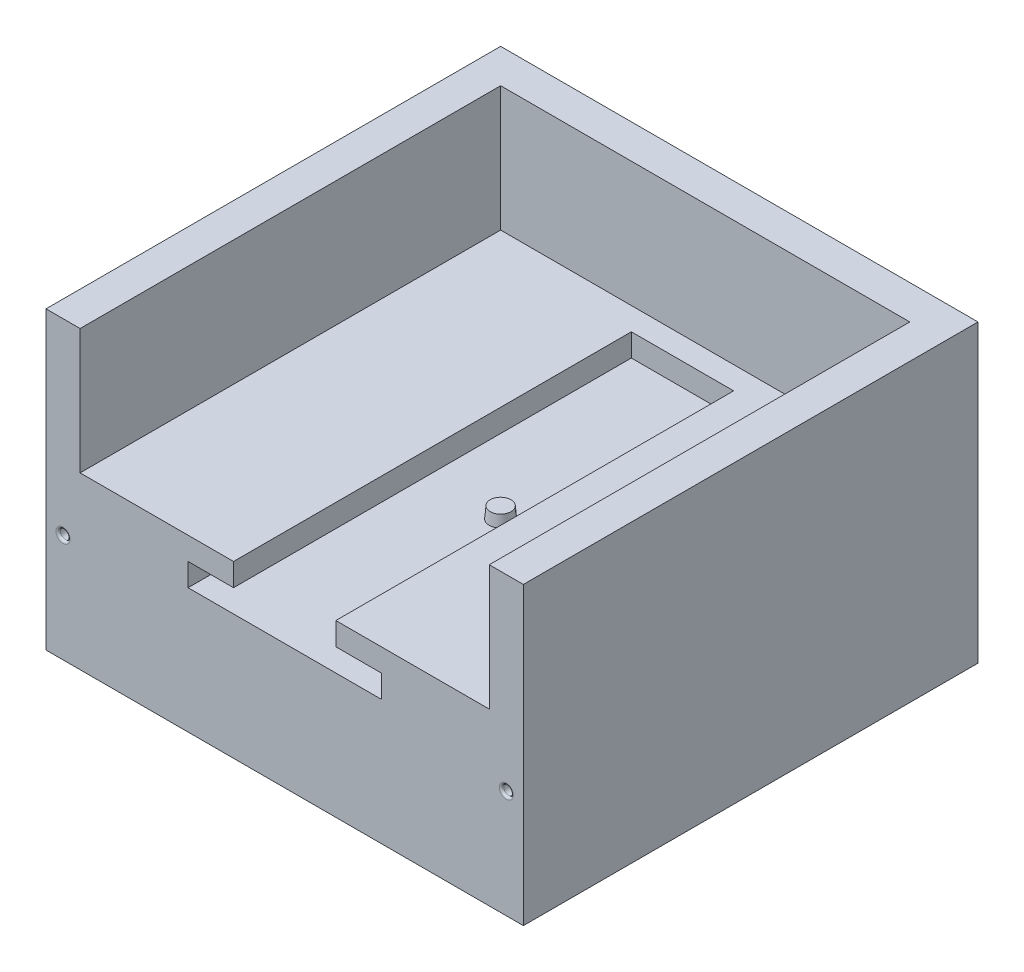
ISO-10303-21;
HEADER;
FILE_DESCRIPTION(('STEP AP214'),'2;1');
FILE_NAME('part.step','',(''),(''),'','','');
FILE_SCHEMA(('AUTOMOTIVE_DESIGN { 1 0 10303 214 1 1 1 1 }'));
ENDSEC;
DATA;
#1=APPLICATION_CONTEXT('core data for automotive mechanical design processes');
#2=APPLICATION_PROTOCOL_DEFINITION('international standard','automotive_design',2000,#1);
#3=PRODUCT_CONTEXT('',#1,'mechanical');
#4=PRODUCT('Part','Part','',(#3));
#5=PRODUCT_RELATED_PRODUCT_CATEGORY('part','',(#4));
#6=PRODUCT_DEFINITION_FORMATION('','',#4);
#7=PRODUCT_DEFINITION_CONTEXT('part definition',#1,'design');
#8=PRODUCT_DEFINITION('design','',#6,#7);
#9=PRODUCT_DEFINITION_SHAPE('','',#8);
#10=(LENGTH_UNIT() NAMED_UNIT(*) SI_UNIT(.MILLI.,.METRE.));
#11=(NAMED_UNIT(*) PLANE_ANGLE_UNIT() SI_UNIT($,.RADIAN.));
#12=(NAMED_UNIT(*) SI_UNIT($,.STERADIAN.) SOLID_ANGLE_UNIT());
#13=UNCERTAINTY_MEASURE_WITH_UNIT(LENGTH_MEASURE(1.E-05),#10,'distance_accuracy_value','');
#14=(GEOMETRIC_REPRESENTATION_CONTEXT(3) GLOBAL_UNCERTAINTY_ASSIGNED_CONTEXT((#13)) GLOBAL_UNIT_ASSIGNED_CONTEXT((#10,
#11,#12)) REPRESENTATION_CONTEXT('',''));
#15=CARTESIAN_POINT('',(0.,0.,0.));
#16=DIRECTION('',(0.,0.,1.));
#17=DIRECTION('',(1.,0.,0.));
#18=AXIS2_PLACEMENT_3D('',#15,#16,#17);
#19=CARTESIAN_POINT('',(0.,75.,0.));
#20=DIRECTION('',(0.,1.,0.));
#21=DIRECTION('',(0.,0.,1.));
#22=AXIS2_PLACEMENT_3D('',#19,#20,#21);
#23=PLANE('',#22);
#24=DIRECTION('',(0.,0.,-1.));
#25=VECTOR('',#24,1.);
#26=CARTESIAN_POINT('',(-90.,75.,0.));
#27=LINE('',#26,#25);
#28=CARTESIAN_POINT('',(-90.,75.,185.));
#29=VERTEX_POINT('',#28);
#30=CARTESIAN_POINT('',(-90.,75.,0.));
#31=VERTEX_POINT('',#30);
#32=EDGE_CURVE('E404',#29,#31,#27,.T.);
#33=ORIENTED_EDGE('',*,*,#32,.T.);
#34=DIRECTION('',(1.,0.,0.));
#35=VECTOR('',#34,1.);
#36=CARTESIAN_POINT('',(-90.,75.,0.));
#37=LINE('',#36,#35);
#38=CARTESIAN_POINT('',(90.,75.,0.));
#39=VERTEX_POINT('',#38);
#40=EDGE_CURVE('E407',#31,#39,#37,.T.);
#41=ORIENTED_EDGE('',*,*,#40,.T.);
#42=DIRECTION('',(0.,0.,1.));
#43=VECTOR('',#42,1.);
#44=CARTESIAN_POINT('',(90.,75.,0.));
#45=LINE('',#44,#43);
#46=CARTESIAN_POINT('',(90.,75.,185.));
#47=VERTEX_POINT('',#46);
#48=EDGE_CURVE('E218',#39,#47,#45,.T.);
#49=ORIENTED_EDGE('',*,*,#48,.T.);
#50=DIRECTION('',(1.,0.,0.));
#51=VECTOR('',#50,1.);
#52=CARTESIAN_POINT('',(-90.,75.,185.));
#53=LINE('',#52,#51);
#54=CARTESIAN_POINT('',(105.,75.,185.));
#55=VERTEX_POINT('',#54);
#56=EDGE_CURVE('E401',#47,#55,#53,.T.);
#57=ORIENTED_EDGE('',*,*,#56,.T.);
#58=DIRECTION('',(0.,0.,-1.));
#59=VECTOR('',#58,1.);
#60=CARTESIAN_POINT('',(105.,75.,-15.));
#61=LINE('',#60,#59);
#62=CARTESIAN_POINT('',(105.,75.,-15.));
#63=VERTEX_POINT('',#62);
#64=EDGE_CURVE('E208',#55,#63,#61,.T.);
#65=ORIENTED_EDGE('',*,*,#64,.T.);
#66=DIRECTION('',(-1.,0.,0.));
#67=VECTOR('',#66,1.);
#68=CARTESIAN_POINT('',(-105.,75.,-15.));
#69=LINE('',#68,#67);
#70=CARTESIAN_POINT('',(-105.,75.,-15.));
#71=VERTEX_POINT('',#70);
#72=EDGE_CURVE('E189',#63,#71,#69,.T.);
#73=ORIENTED_EDGE('',*,*,#72,.T.);
#74=DIRECTION('',(0.,0.,1.));
#75=VECTOR('',#74,1.);
#76=CARTESIAN_POINT('',(-105.,75.,185.));
#77=LINE('',#76,#75);
#78=CARTESIAN_POINT('',(-105.,75.,185.));
#79=VERTEX_POINT('',#78);
#80=EDGE_CURVE('E205',#71,#79,#77,.T.);
#81=ORIENTED_EDGE('',*,*,#80,.T.);
#82=EDGE_CURVE('E211',#79,#29,#53,.T.);
#83=ORIENTED_EDGE('',*,*,#82,.T.);
#84=EDGE_LOOP('',(#33,#41,#49,#57,#65,#73,#81,#83));
#85=FACE_BOUND('',#84,.T.);
#86=ADVANCED_FACE('F47',(#85),#23,.T.);
#87=CARTESIAN_POINT('',(-105.,225.,-15.));
#88=DIRECTION('',(0.,0.,1.));
#89=DIRECTION('',(1.,0.,0.));
#90=AXIS2_PLACEMENT_3D('',#87,#88,#89);
#91=PLANE('',#90);
#92=DIRECTION('',(-1.,0.,0.));
#93=VECTOR('',#92,1.);
#94=CARTESIAN_POINT('',(0.,10.25,-15.));
#95=LINE('',#94,#93);
#96=CARTESIAN_POINT('',(42.5,10.25,-15.));
#97=VERTEX_POINT('',#96);
#98=CARTESIAN_POINT('',(21.5,10.25,-15.));
#99=VERTEX_POINT('',#98);
#100=EDGE_CURVE('E57',#97,#99,#95,.T.);
#101=ORIENTED_EDGE('',*,*,#100,.T.);
#102=DIRECTION('',(0.,-1.,0.));
#103=VECTOR('',#102,1.);
#104=CARTESIAN_POINT('',(21.5,0.,-15.));
#105=LINE('',#104,#103);
#106=CARTESIAN_POINT('',(21.5,0.,-15.));
#107=VERTEX_POINT('',#106);
#108=EDGE_CURVE('E11',#99,#107,#105,.T.);
#109=ORIENTED_EDGE('',*,*,#108,.T.);
#110=DIRECTION('',(-1.,0.,0.));
#111=VECTOR('',#110,1.);
#112=CARTESIAN_POINT('',(0.,0.,-15.));
#113=LINE('',#112,#111);
#114=CARTESIAN_POINT('',(42.5,0.,-15.));
#115=VERTEX_POINT('',#114);
#116=EDGE_CURVE('E382',#115,#107,#113,.T.);
#117=ORIENTED_EDGE('',*,*,#116,.F.);
#118=DIRECTION('',(0.,-1.,0.));
#119=VECTOR('',#118,1.);
#120=CARTESIAN_POINT('',(42.5,0.,-15.));
#121=LINE('',#120,#119);
#122=EDGE_CURVE('E390',#97,#115,#121,.T.);
#123=ORIENTED_EDGE('',*,*,#122,.F.);
#124=EDGE_LOOP('',(#101,#109,#117,#123));
#125=FACE_BOUND('',#124,.T.);
#126=ORIENTED_EDGE('',*,*,#72,.F.);
#127=DIRECTION('',(0.,-1.,0.));
#128=VECTOR('',#127,1.);
#129=CARTESIAN_POINT('',(105.,225.,-15.));
#130=LINE('',#129,#128);
#131=CARTESIAN_POINT('',(105.,-55.,-14.9999999999999));
#132=VERTEX_POINT('',#131);
#133=EDGE_CURVE('E199',#63,#132,#130,.T.);
#134=ORIENTED_EDGE('',*,*,#133,.T.);
#135=DIRECTION('',(1.,0.,0.));
#136=VECTOR('',#135,1.);
#137=CARTESIAN_POINT('',(0.,-55.,-15.));
#138=LINE('',#137,#136);
#139=CARTESIAN_POINT('',(-105.,-55.,-15.));
#140=VERTEX_POINT('',#139);
#141=EDGE_CURVE('E192',#140,#132,#138,.T.);
#142=ORIENTED_EDGE('',*,*,#141,.F.);
#143=DIRECTION('',(0.,-1.,0.));
#144=VECTOR('',#143,1.);
#145=CARTESIAN_POINT('',(-105.,225.,-15.));
#146=LINE('',#145,#144);
#147=EDGE_CURVE('E186',#71,#140,#146,.T.);
#148=ORIENTED_EDGE('',*,*,#147,.F.);
#149=EDGE_LOOP('',(#126,#134,#142,#148));
#150=FACE_BOUND('',#149,.T.);
#151=ADVANCED_FACE('F188',(#125,#150),#91,.F.);
#152=CARTESIAN_POINT('',(-90.,225.,185.));
#153=DIRECTION('',(0.,0.,-1.));
#154=DIRECTION('',(-1.,0.,0.));
#155=AXIS2_PLACEMENT_3D('',#152,#153,#154);
#156=PLANE('',#155);
#157=CARTESIAN_POINT('',(97.4999999999999,-7.50000000000001,185.));
#158=DIRECTION('',(0.,0.,-1.));
#159=DIRECTION('',(-1.,0.,0.));
#160=AXIS2_PLACEMENT_3D('',#157,#158,#159);
#161=CIRCLE('',#160,3.1);
#162=CARTESIAN_POINT('',(94.3999999999999,-7.50000000000001,185.));
#163=VERTEX_POINT('',#162);
#164=EDGE_CURVE('E542',#163,#163,#161,.T.);
#165=ORIENTED_EDGE('',*,*,#164,.T.);
#166=EDGE_LOOP('',(#165));
#167=FACE_BOUND('',#166,.T.);
#168=CARTESIAN_POINT('',(-97.4999999999999,-7.50000000000001,185.));
#169=DIRECTION('',(0.,0.,-1.));
#170=DIRECTION('',(-1.,0.,0.));
#171=AXIS2_PLACEMENT_3D('',#168,#169,#170);
#172=CIRCLE('',#171,3.1);
#173=CARTESIAN_POINT('',(-100.6,-7.50000000000001,185.));
#174=VERTEX_POINT('',#173);
#175=EDGE_CURVE('E539',#174,#174,#172,.T.);
#176=ORIENTED_EDGE('',*,*,#175,.T.);
#177=EDGE_LOOP('',(#176));
#178=FACE_BOUND('',#177,.T.);
#179=ORIENTED_EDGE('',*,*,#82,.F.);
#180=DIRECTION('',(0.,-1.,0.));
#181=VECTOR('',#180,1.);
#182=CARTESIAN_POINT('',(-105.,225.,185.));
#183=LINE('',#182,#181);
#184=CARTESIAN_POINT('',(-105.,-55.,185.));
#185=VERTEX_POINT('',#184);
#186=EDGE_CURVE('E198',#79,#185,#183,.T.);
#187=ORIENTED_EDGE('',*,*,#186,.T.);
#188=DIRECTION('',(-1.,0.,0.));
#189=VECTOR('',#188,1.);
#190=CARTESIAN_POINT('',(0.,-55.,185.));
#191=LINE('',#190,#189);
#192=CARTESIAN_POINT('',(105.,-55.,185.));
#193=VERTEX_POINT('',#192);
#194=EDGE_CURVE('E341',#193,#185,#191,.T.);
#195=ORIENTED_EDGE('',*,*,#194,.F.);
#196=DIRECTION('',(0.,-1.,0.));
#197=VECTOR('',#196,1.);
#198=CARTESIAN_POINT('',(105.,225.,185.));
#199=LINE('',#198,#197);
#200=EDGE_CURVE('E232',#55,#193,#199,.T.);
#201=ORIENTED_EDGE('',*,*,#200,.F.);
#202=ORIENTED_EDGE('',*,*,#56,.F.);
#203=DIRECTION('',(0.,-1.,0.));
#204=VECTOR('',#203,1.);
#205=CARTESIAN_POINT('',(90.,225.,185.));
#206=LINE('',#205,#204);
#207=CARTESIAN_POINT('',(90.,20.,185.));
#208=VERTEX_POINT('',#207);
#209=EDGE_CURVE('E229',#47,#208,#206,.T.);
#210=ORIENTED_EDGE('',*,*,#209,.T.);
#211=DIRECTION('',(1.,0.,0.));
#212=VECTOR('',#211,1.);
#213=CARTESIAN_POINT('',(22.5,20.,185.));
#214=LINE('',#213,#212);
#215=CARTESIAN_POINT('',(22.5,20.,185.));
#216=VERTEX_POINT('',#215);
#217=EDGE_CURVE('E302',#216,#208,#214,.T.);
#218=ORIENTED_EDGE('',*,*,#217,.F.);
#219=DIRECTION('',(0.,-1.,0.));
#220=VECTOR('',#219,1.);
#221=CARTESIAN_POINT('',(22.5,20.,185.));
#222=LINE('',#221,#220);
#223=CARTESIAN_POINT('',(22.5,10.,185.));
#224=VERTEX_POINT('',#223);
#225=EDGE_CURVE('E267',#216,#224,#222,.T.);
#226=ORIENTED_EDGE('',*,*,#225,.T.);
#227=DIRECTION('',(1.,0.,0.));
#228=VECTOR('',#227,1.);
#229=CARTESIAN_POINT('',(22.5,10.,185.));
#230=LINE('',#229,#228);
#231=CARTESIAN_POINT('',(42.5,10.,185.));
#232=VERTEX_POINT('',#231);
#233=EDGE_CURVE('E278',#224,#232,#230,.T.);
#234=ORIENTED_EDGE('',*,*,#233,.T.);
#235=DIRECTION('',(0.,1.,0.));
#236=VECTOR('',#235,1.);
#237=CARTESIAN_POINT('',(42.5,0.,185.));
#238=LINE('',#237,#236);
#239=CARTESIAN_POINT('',(42.5,0.,185.));
#240=VERTEX_POINT('',#239);
#241=EDGE_CURVE('E353',#240,#232,#238,.T.);
#242=ORIENTED_EDGE('',*,*,#241,.F.);
#243=DIRECTION('',(-1.,0.,0.));
#244=VECTOR('',#243,1.);
#245=CARTESIAN_POINT('',(-105.,0.,185.));
#246=LINE('',#245,#244);
#247=CARTESIAN_POINT('',(-42.5,0.,185.));
#248=VERTEX_POINT('',#247);
#249=EDGE_CURVE('E294',#240,#248,#246,.T.);
#250=ORIENTED_EDGE('',*,*,#249,.T.);
#251=DIRECTION('',(0.,-1.,0.));
#252=VECTOR('',#251,1.);
#253=CARTESIAN_POINT('',(-42.5,10.,185.));
#254=LINE('',#253,#252);
#255=CARTESIAN_POINT('',(-42.5,10.,185.));
#256=VERTEX_POINT('',#255);
#257=EDGE_CURVE('E360',#256,#248,#254,.T.);
#258=ORIENTED_EDGE('',*,*,#257,.F.);
#259=DIRECTION('',(1.,0.,0.));
#260=VECTOR('',#259,1.);
#261=CARTESIAN_POINT('',(-90.,10.,185.));
#262=LINE('',#261,#260);
#263=CARTESIAN_POINT('',(-22.5,10.,185.));
#264=VERTEX_POINT('',#263);
#265=EDGE_CURVE('E291',#256,#264,#262,.T.);
#266=ORIENTED_EDGE('',*,*,#265,.T.);
#267=DIRECTION('',(0.,-1.,0.));
#268=VECTOR('',#267,1.);
#269=CARTESIAN_POINT('',(-22.5,20.,185.));
#270=LINE('',#269,#268);
#271=CARTESIAN_POINT('',(-22.5,20.,185.));
#272=VERTEX_POINT('',#271);
#273=EDGE_CURVE('E247',#272,#264,#270,.T.);
#274=ORIENTED_EDGE('',*,*,#273,.F.);
#275=DIRECTION('',(1.,0.,0.));
#276=VECTOR('',#275,1.);
#277=CARTESIAN_POINT('',(-90.,20.,185.));
#278=LINE('',#277,#276);
#279=CARTESIAN_POINT('',(-90.,20.,185.));
#280=VERTEX_POINT('',#279);
#281=EDGE_CURVE('E315',#280,#272,#278,.T.);
#282=ORIENTED_EDGE('',*,*,#281,.F.);
#283=DIRECTION('',(0.,-1.,0.));
#284=VECTOR('',#283,1.);
#285=CARTESIAN_POINT('',(-90.,225.,185.));
#286=LINE('',#285,#284);
#287=EDGE_CURVE('E51',#29,#280,#286,.T.);
#288=ORIENTED_EDGE('',*,*,#287,.F.);
#289=EDGE_LOOP('',(#179,#187,#195,#201,#202,#210,#218,#226,#234,#242,#250,#258,#266,#274,#282,#288));
#290=FACE_BOUND('',#289,.T.);
#291=ADVANCED_FACE('F419',(#167,#178,#290),#156,.F.);
#292=CARTESIAN_POINT('',(-90.,225.,0.));
#293=DIRECTION('',(-1.,0.,0.));
#294=DIRECTION('',(0.,0.,1.));
#295=AXIS2_PLACEMENT_3D('',#292,#293,#294);
#296=PLANE('',#295);
#297=ORIENTED_EDGE('',*,*,#32,.F.);
#298=ORIENTED_EDGE('',*,*,#287,.T.);
#299=DIRECTION('',(0.,0.,1.));
#300=VECTOR('',#299,1.);
#301=CARTESIAN_POINT('',(-90.,20.,185.));
#302=LINE('',#301,#300);
#303=CARTESIAN_POINT('',(-90.,20.,0.));
#304=VERTEX_POINT('',#303);
#305=EDGE_CURVE('E277',#304,#280,#302,.T.);
#306=ORIENTED_EDGE('',*,*,#305,.F.);
#307=DIRECTION('',(0.,-1.,0.));
#308=VECTOR('',#307,1.);
#309=CARTESIAN_POINT('',(-90.,225.,0.));
#310=LINE('',#309,#308);
#311=EDGE_CURVE('E222',#31,#304,#310,.T.);
#312=ORIENTED_EDGE('',*,*,#311,.F.);
#313=EDGE_LOOP('',(#297,#298,#306,#312));
#314=FACE_BOUND('',#313,.T.);
#315=ADVANCED_FACE('F447',(#314),#296,.F.);
#316=CARTESIAN_POINT('',(-90.,225.,0.));
#317=DIRECTION('',(0.,0.,-1.));
#318=DIRECTION('',(-1.,0.,0.));
#319=AXIS2_PLACEMENT_3D('',#316,#317,#318);
#320=PLANE('',#319);
#321=ORIENTED_EDGE('',*,*,#40,.F.);
#322=ORIENTED_EDGE('',*,*,#311,.T.);
#323=DIRECTION('',(-1.,0.,0.));
#324=VECTOR('',#323,1.);
#325=CARTESIAN_POINT('',(-90.,20.,0.));
#326=LINE('',#325,#324);
#327=CARTESIAN_POINT('',(90.,20.,0.));
#328=VERTEX_POINT('',#327);
#329=EDGE_CURVE('E271',#328,#304,#326,.T.);
#330=ORIENTED_EDGE('',*,*,#329,.F.);
#331=DIRECTION('',(0.,-1.,0.));
#332=VECTOR('',#331,1.);
#333=CARTESIAN_POINT('',(90.,225.,0.));
#334=LINE('',#333,#332);
#335=EDGE_CURVE('E225',#39,#328,#334,.T.);
#336=ORIENTED_EDGE('',*,*,#335,.F.);
#337=EDGE_LOOP('',(#321,#322,#330,#336));
#338=FACE_BOUND('',#337,.T.);
#339=ADVANCED_FACE('F460',(#338),#320,.F.);
#340=CARTESIAN_POINT('',(90.,225.,0.));
#341=DIRECTION('',(1.,0.,0.));
#342=DIRECTION('',(0.,0.,-1.));
#343=AXIS2_PLACEMENT_3D('',#340,#341,#342);
#344=PLANE('',#343);
#345=ORIENTED_EDGE('',*,*,#48,.F.);
#346=ORIENTED_EDGE('',*,*,#335,.T.);
#347=DIRECTION('',(0.,0.,-1.));
#348=VECTOR('',#347,1.);
#349=CARTESIAN_POINT('',(90.,20.,0.));
#350=LINE('',#349,#348);
#351=EDGE_CURVE('E298',#208,#328,#350,.T.);
#352=ORIENTED_EDGE('',*,*,#351,.F.);
#353=ORIENTED_EDGE('',*,*,#209,.F.);
#354=EDGE_LOOP('',(#345,#346,#352,#353));
#355=FACE_BOUND('',#354,.T.);
#356=ADVANCED_FACE('F49',(#355),#344,.F.);
#357=CARTESIAN_POINT('',(105.,225.,-15.));
#358=DIRECTION('',(-1.,0.,0.));
#359=DIRECTION('',(0.,0.,1.));
#360=AXIS2_PLACEMENT_3D('',#357,#358,#359);
#361=PLANE('',#360);
#362=ORIENTED_EDGE('',*,*,#64,.F.);
#363=ORIENTED_EDGE('',*,*,#200,.T.);
#364=DIRECTION('',(0.,0.,1.));
#365=VECTOR('',#364,1.);
#366=CARTESIAN_POINT('',(105.,-55.,0.));
#367=LINE('',#366,#365);
#368=EDGE_CURVE('E332',#132,#193,#367,.T.);
#369=ORIENTED_EDGE('',*,*,#368,.F.);
#370=ORIENTED_EDGE('',*,*,#133,.F.);
#371=EDGE_LOOP('',(#362,#363,#369,#370));
#372=FACE_BOUND('',#371,.T.);
#373=ADVANCED_FACE('F422',(#372),#361,.F.);
#374=CARTESIAN_POINT('',(-105.,225.,185.));
#375=DIRECTION('',(1.,0.,0.));
#376=DIRECTION('',(0.,0.,-1.));
#377=AXIS2_PLACEMENT_3D('',#374,#375,#376);
#378=PLANE('',#377);
#379=ORIENTED_EDGE('',*,*,#80,.F.);
#380=ORIENTED_EDGE('',*,*,#147,.T.);
#381=DIRECTION('',(0.,0.,-1.));
#382=VECTOR('',#381,1.);
#383=CARTESIAN_POINT('',(-105.,-55.,0.));
#384=LINE('',#383,#382);
#385=EDGE_CURVE('E338',#185,#140,#384,.T.);
#386=ORIENTED_EDGE('',*,*,#385,.F.);
#387=ORIENTED_EDGE('',*,*,#186,.F.);
#388=EDGE_LOOP('',(#379,#380,#386,#387));
#389=FACE_BOUND('',#388,.T.);
#390=ADVANCED_FACE('F213',(#389),#378,.F.);
#391=DIRECTION('',(1.,0.,0.));
#392=VECTOR('',#391,1.);
#393=CARTESIAN_POINT('',(-90.,0.,0.));
#394=LINE('',#393,#392);
#395=CARTESIAN_POINT('',(-42.5,0.,0.));
#396=VERTEX_POINT('',#395);
#397=CARTESIAN_POINT('',(21.5,0.,0.));
#398=VERTEX_POINT('',#397);
#399=EDGE_CURVE('E240',#396,#398,#394,.T.);
#400=ORIENTED_EDGE('',*,*,#399,.T.);
#401=DIRECTION('',(0.,1.,0.));
#402=VECTOR('',#401,1.);
#403=CARTESIAN_POINT('',(21.5,0.,0.));
#404=LINE('',#403,#402);
#405=CARTESIAN_POINT('',(21.4999999999999,10.,0.));
#406=VERTEX_POINT('',#405);
#407=EDGE_CURVE('E373',#398,#406,#404,.T.);
#408=ORIENTED_EDGE('',*,*,#407,.T.);
#409=DIRECTION('',(-1.,0.,0.));
#410=VECTOR('',#409,1.);
#411=CARTESIAN_POINT('',(-90.,10.,0.));
#412=LINE('',#411,#410);
#413=CARTESIAN_POINT('',(-42.5,10.,0.));
#414=VERTEX_POINT('',#413);
#415=EDGE_CURVE('E276',#406,#414,#412,.T.);
#416=ORIENTED_EDGE('',*,*,#415,.T.);
#417=DIRECTION('',(0.,1.,0.));
#418=VECTOR('',#417,1.);
#419=CARTESIAN_POINT('',(-42.5,0.,0.));
#420=LINE('',#419,#418);
#421=EDGE_CURVE('E366',#396,#414,#420,.T.);
#422=ORIENTED_EDGE('',*,*,#421,.F.);
#423=EDGE_LOOP('',(#400,#408,#416,#422));
#424=FACE_BOUND('',#423,.T.);
#425=ADVANCED_FACE('F456',(#424),#320,.F.);
#426=CARTESIAN_POINT('',(-22.5,20.,185.));
#427=DIRECTION('',(-1.,0.,0.));
#428=DIRECTION('',(0.,0.,1.));
#429=AXIS2_PLACEMENT_3D('',#426,#427,#428);
#430=PLANE('',#429);
#431=DIRECTION('',(0.,0.,-1.));
#432=VECTOR('',#431,1.);
#433=CARTESIAN_POINT('',(-22.5,10.,185.));
#434=LINE('',#433,#432);
#435=CARTESIAN_POINT('',(-22.5,10.,10.));
#436=VERTEX_POINT('',#435);
#437=EDGE_CURVE('E288',#264,#436,#434,.T.);
#438=ORIENTED_EDGE('',*,*,#437,.T.);
#439=DIRECTION('',(0.,-1.,0.));
#440=VECTOR('',#439,1.);
#441=CARTESIAN_POINT('',(-22.5,20.,10.));
#442=LINE('',#441,#440);
#443=CARTESIAN_POINT('',(-22.5,20.,10.));
#444=VERTEX_POINT('',#443);
#445=EDGE_CURVE('E255',#444,#436,#442,.T.);
#446=ORIENTED_EDGE('',*,*,#445,.F.);
#447=DIRECTION('',(0.,0.,-1.));
#448=VECTOR('',#447,1.);
#449=CARTESIAN_POINT('',(-22.5,20.,185.));
#450=LINE('',#449,#448);
#451=EDGE_CURVE('E312',#272,#444,#450,.T.);
#452=ORIENTED_EDGE('',*,*,#451,.F.);
#453=ORIENTED_EDGE('',*,*,#273,.T.);
#454=EDGE_LOOP('',(#438,#446,#452,#453));
#455=FACE_BOUND('',#454,.T.);
#456=ADVANCED_FACE('F459',(#455),#430,.F.);
#457=CARTESIAN_POINT('',(-22.5,20.,10.));
#458=DIRECTION('',(0.,0.,-1.));
#459=DIRECTION('',(-1.,0.,0.));
#460=AXIS2_PLACEMENT_3D('',#457,#458,#459);
#461=PLANE('',#460);
#462=DIRECTION('',(1.,0.,0.));
#463=VECTOR('',#462,1.);
#464=CARTESIAN_POINT('',(-22.5,10.,10.));
#465=LINE('',#464,#463);
#466=CARTESIAN_POINT('',(22.4999999999999,10.,10.));
#467=VERTEX_POINT('',#466);
#468=EDGE_CURVE('E285',#436,#467,#465,.T.);
#469=ORIENTED_EDGE('',*,*,#468,.T.);
#470=DIRECTION('',(0.,-1.,0.));
#471=VECTOR('',#470,1.);
#472=CARTESIAN_POINT('',(22.4999999999999,20.,10.));
#473=LINE('',#472,#471);
#474=CARTESIAN_POINT('',(22.4999999999999,20.,10.));
#475=VERTEX_POINT('',#474);
#476=EDGE_CURVE('E263',#475,#467,#473,.T.);
#477=ORIENTED_EDGE('',*,*,#476,.F.);
#478=DIRECTION('',(1.,0.,0.));
#479=VECTOR('',#478,1.);
#480=CARTESIAN_POINT('',(-22.5,20.,10.));
#481=LINE('',#480,#479);
#482=EDGE_CURVE('E309',#444,#475,#481,.T.);
#483=ORIENTED_EDGE('',*,*,#482,.F.);
#484=ORIENTED_EDGE('',*,*,#445,.T.);
#485=EDGE_LOOP('',(#469,#477,#483,#484));
#486=FACE_BOUND('',#485,.T.);
#487=ADVANCED_FACE('F464',(#486),#461,.F.);
#488=CARTESIAN_POINT('',(22.4999999999999,20.,10.));
#489=DIRECTION('',(1.,0.,0.));
#490=DIRECTION('',(0.,0.,-1.));
#491=AXIS2_PLACEMENT_3D('',#488,#489,#490);
#492=PLANE('',#491);
#493=DIRECTION('',(0.,0.,1.));
#494=VECTOR('',#493,1.);
#495=CARTESIAN_POINT('',(22.4999999999999,10.,10.));
#496=LINE('',#495,#494);
#497=EDGE_CURVE('E282',#467,#224,#496,.T.);
#498=ORIENTED_EDGE('',*,*,#497,.T.);
#499=ORIENTED_EDGE('',*,*,#225,.F.);
#500=DIRECTION('',(0.,0.,1.));
#501=VECTOR('',#500,1.);
#502=CARTESIAN_POINT('',(22.4999999999999,20.,10.));
#503=LINE('',#502,#501);
#504=EDGE_CURVE('E306',#475,#216,#503,.T.);
#505=ORIENTED_EDGE('',*,*,#504,.F.);
#506=ORIENTED_EDGE('',*,*,#476,.T.);
#507=EDGE_LOOP('',(#498,#499,#505,#506));
#508=FACE_BOUND('',#507,.T.);
#509=ADVANCED_FACE('F568',(#508),#492,.F.);
#510=CARTESIAN_POINT('',(0.,20.,0.));
#511=DIRECTION('',(0.,-1.,0.));
#512=DIRECTION('',(0.,0.,-1.));
#513=AXIS2_PLACEMENT_3D('',#510,#511,#512);
#514=PLANE('',#513);
#515=ORIENTED_EDGE('',*,*,#305,.T.);
#516=ORIENTED_EDGE('',*,*,#281,.T.);
#517=ORIENTED_EDGE('',*,*,#451,.T.);
#518=ORIENTED_EDGE('',*,*,#482,.T.);
#519=ORIENTED_EDGE('',*,*,#504,.T.);
#520=ORIENTED_EDGE('',*,*,#217,.T.);
#521=ORIENTED_EDGE('',*,*,#351,.T.);
#522=ORIENTED_EDGE('',*,*,#329,.T.);
#523=EDGE_LOOP('',(#515,#516,#517,#518,#519,#520,#521,#522));
#524=FACE_BOUND('',#523,.T.);
#525=ADVANCED_FACE('F474',(#524),#514,.F.);
#526=CARTESIAN_POINT('',(0.,10.,0.));
#527=DIRECTION('',(0.,-1.,0.));
#528=DIRECTION('',(0.,0.,-1.));
#529=AXIS2_PLACEMENT_3D('',#526,#527,#528);
#530=PLANE('',#529);
#531=DIRECTION('',(0.,0.,1.));
#532=VECTOR('',#531,1.);
#533=CARTESIAN_POINT('',(-42.5,10.,0.));
#534=LINE('',#533,#532);
#535=EDGE_CURVE('E363',#414,#256,#534,.T.);
#536=ORIENTED_EDGE('',*,*,#535,.F.);
#537=ORIENTED_EDGE('',*,*,#415,.F.);
#538=CARTESIAN_POINT('',(42.5,10.,0.));
#539=VERTEX_POINT('',#538);
#540=EDGE_CURVE('E272',#539,#406,#412,.T.);
#541=ORIENTED_EDGE('',*,*,#540,.F.);
#542=DIRECTION('',(0.,0.,-1.));
#543=VECTOR('',#542,1.);
#544=CARTESIAN_POINT('',(42.5,10.,185.));
#545=LINE('',#544,#543);
#546=EDGE_CURVE('E349',#232,#539,#545,.T.);
#547=ORIENTED_EDGE('',*,*,#546,.F.);
#548=ORIENTED_EDGE('',*,*,#233,.F.);
#549=ORIENTED_EDGE('',*,*,#497,.F.);
#550=ORIENTED_EDGE('',*,*,#468,.F.);
#551=ORIENTED_EDGE('',*,*,#437,.F.);
#552=ORIENTED_EDGE('',*,*,#265,.F.);
#553=EDGE_LOOP('',(#536,#537,#541,#547,#548,#549,#550,#551,#552));
#554=FACE_BOUND('',#553,.T.);
#555=ADVANCED_FACE('F483',(#554),#530,.T.);
#556=CARTESIAN_POINT('',(0.,0.,0.));
#557=DIRECTION('',(0.,-1.,0.));
#558=DIRECTION('',(0.,0.,-1.));
#559=AXIS2_PLACEMENT_3D('',#556,#557,#558);
#560=PLANE('',#559);
#561=CARTESIAN_POINT('',(0.,0.,90.));
#562=DIRECTION('',(0.,-1.,0.));
#563=DIRECTION('',(0.,0.,-1.));
#564=AXIS2_PLACEMENT_3D('',#561,#562,#563);
#565=CIRCLE('',#564,5.00000000000001);
#566=CARTESIAN_POINT('',(0.,0.,85.));
#567=VERTEX_POINT('',#566);
#568=EDGE_CURVE('E226',#567,#567,#565,.F.);
#569=ORIENTED_EDGE('',*,*,#568,.F.);
#570=EDGE_LOOP('',(#569));
#571=FACE_BOUND('',#570,.T.);
#572=ORIENTED_EDGE('',*,*,#399,.F.);
#573=DIRECTION('',(0.,0.,-1.));
#574=VECTOR('',#573,1.);
#575=CARTESIAN_POINT('',(-42.5,0.,185.));
#576=LINE('',#575,#574);
#577=EDGE_CURVE('E370',#248,#396,#576,.T.);
#578=ORIENTED_EDGE('',*,*,#577,.F.);
#579=ORIENTED_EDGE('',*,*,#249,.F.);
#580=DIRECTION('',(0.,0.,1.));
#581=VECTOR('',#580,1.);
#582=CARTESIAN_POINT('',(42.5,0.,0.));
#583=LINE('',#582,#581);
#584=EDGE_CURVE('E356',#115,#240,#583,.T.);
#585=ORIENTED_EDGE('',*,*,#584,.F.);
#586=ORIENTED_EDGE('',*,*,#116,.T.);
#587=DIRECTION('',(0.,0.,-1.));
#588=VECTOR('',#587,1.);
#589=CARTESIAN_POINT('',(21.5,0.,23.3679802293651));
#590=LINE('',#589,#588);
#591=EDGE_CURVE('E378',#398,#107,#590,.T.);
#592=ORIENTED_EDGE('',*,*,#591,.F.);
#593=EDGE_LOOP('',(#572,#578,#579,#585,#586,#592));
#594=FACE_BOUND('',#593,.T.);
#595=ADVANCED_FACE('F493',(#571,#594),#560,.F.);
#596=CARTESIAN_POINT('',(-97.4999999999999,-7.50000000000001,180.5));
#597=DIRECTION('',(0.,0.,1.));
#598=DIRECTION('',(1.,0.,0.));
#599=AXIS2_PLACEMENT_3D('',#596,#597,#598);
#600=CYLINDRICAL_SURFACE('',#599,2.1);
#601=CARTESIAN_POINT('',(-97.4999999999999,-7.50000000000001,184.));
#602=DIRECTION('',(0.,0.,-1.));
#603=DIRECTION('',(-1.,0.,0.));
#604=AXIS2_PLACEMENT_3D('',#601,#602,#603);
#605=CIRCLE('',#604,2.1);
#606=CARTESIAN_POINT('',(-99.6,-7.50000000000001,184.));
#607=VERTEX_POINT('',#606);
#608=EDGE_CURVE('E210',#607,#607,#605,.F.);
#609=ORIENTED_EDGE('',*,*,#608,.T.);
#610=EDGE_LOOP('',(#609));
#611=FACE_BOUND('',#610,.T.);
#612=CARTESIAN_POINT('',(-97.4999999999999,-7.50000000000001,180.5));
#613=DIRECTION('',(0.,0.,1.));
#614=DIRECTION('',(1.,0.,0.));
#615=AXIS2_PLACEMENT_3D('',#612,#613,#614);
#616=CIRCLE('',#615,2.1);
#617=CARTESIAN_POINT('',(-95.3999999999999,-7.50000000000001,180.5));
#618=VERTEX_POINT('',#617);
#619=EDGE_CURVE('E324',#618,#618,#616,.T.);
#620=ORIENTED_EDGE('',*,*,#619,.F.);
#621=EDGE_LOOP('',(#620));
#622=FACE_BOUND('',#621,.T.);
#623=ADVANCED_FACE('F557',(#611,#622),#600,.F.);
#624=CARTESIAN_POINT('',(-97.4999999999999,-7.50000000000001,180.5));
#625=DIRECTION('',(0.,0.,1.));
#626=DIRECTION('',(1.,0.,0.));
#627=AXIS2_PLACEMENT_3D('',#624,#625,#626);
#628=PLANE('',#627);
#629=ORIENTED_EDGE('',*,*,#619,.T.);
#630=EDGE_LOOP('',(#629));
#631=FACE_BOUND('',#630,.T.);
#632=ADVANCED_FACE('F580',(#631),#628,.T.);
#633=CARTESIAN_POINT('',(97.4999999999999,-7.50000000000001,180.5));
#634=DIRECTION('',(0.,0.,1.));
#635=DIRECTION('',(1.,0.,0.));
#636=AXIS2_PLACEMENT_3D('',#633,#634,#635);
#637=CYLINDRICAL_SURFACE('',#636,2.1);
#638=CARTESIAN_POINT('',(97.4999999999999,-7.50000000000001,184.));
#639=DIRECTION('',(0.,0.,-1.));
#640=DIRECTION('',(-1.,0.,0.));
#641=AXIS2_PLACEMENT_3D('',#638,#639,#640);
#642=CIRCLE('',#641,2.1);
#643=CARTESIAN_POINT('',(95.3999999999999,-7.50000000000001,184.));
#644=VERTEX_POINT('',#643);
#645=EDGE_CURVE('E547',#644,#644,#642,.F.);
#646=ORIENTED_EDGE('',*,*,#645,.T.);
#647=EDGE_LOOP('',(#646));
#648=FACE_BOUND('',#647,.T.);
#649=CARTESIAN_POINT('',(97.4999999999999,-7.50000000000001,180.5));
#650=DIRECTION('',(0.,0.,-1.));
#651=DIRECTION('',(-1.,0.,0.));
#652=AXIS2_PLACEMENT_3D('',#649,#650,#651);
#653=CIRCLE('',#652,2.1);
#654=CARTESIAN_POINT('',(95.3999999999999,-7.50000000000001,180.5));
#655=VERTEX_POINT('',#654);
#656=EDGE_CURVE('E328',#655,#655,#653,.T.);
#657=ORIENTED_EDGE('',*,*,#656,.T.);
#658=EDGE_LOOP('',(#657));
#659=FACE_BOUND('',#658,.T.);
#660=ADVANCED_FACE('F436',(#648,#659),#637,.F.);
#661=CARTESIAN_POINT('',(97.4999999999999,-7.50000000000001,180.5));
#662=DIRECTION('',(0.,0.,-1.));
#663=DIRECTION('',(-1.,0.,0.));
#664=AXIS2_PLACEMENT_3D('',#661,#662,#663);
#665=PLANE('',#664);
#666=ORIENTED_EDGE('',*,*,#656,.F.);
#667=EDGE_LOOP('',(#666));
#668=FACE_BOUND('',#667,.T.);
#669=ADVANCED_FACE('F427',(#668),#665,.F.);
#670=CARTESIAN_POINT('',(0.,-55.,0.));
#671=DIRECTION('',(0.,-1.,0.));
#672=DIRECTION('',(0.,0.,-1.));
#673=AXIS2_PLACEMENT_3D('',#670,#671,#672);
#674=PLANE('',#673);
#675=ORIENTED_EDGE('',*,*,#194,.T.);
#676=ORIENTED_EDGE('',*,*,#385,.T.);
#677=ORIENTED_EDGE('',*,*,#141,.T.);
#678=ORIENTED_EDGE('',*,*,#368,.T.);
#679=EDGE_LOOP('',(#675,#676,#677,#678));
#680=FACE_BOUND('',#679,.T.);
#681=ADVANCED_FACE('F424',(#680),#674,.T.);
#682=CARTESIAN_POINT('',(0.,0.,90.));
#683=DIRECTION('',(0.,-1.,0.));
#684=DIRECTION('',(0.,0.,1.));
#685=AXIS2_PLACEMENT_3D('',#682,#683,#684);
#686=CONICAL_SURFACE('',#685,5.00000000000001,0.0872664625997167);
#687=CARTESIAN_POINT('',(0.,5.,90.));
#688=DIRECTION('',(0.,1.,0.));
#689=DIRECTION('',(0.,0.,1.));
#690=AXIS2_PLACEMENT_3D('',#687,#688,#689);
#691=CIRCLE('',#690,4.56255668237039);
#692=CARTESIAN_POINT('',(0.,5.,94.5625566823704));
#693=VERTEX_POINT('',#692);
#694=EDGE_CURVE('E345',#693,#693,#691,.T.);
#695=ORIENTED_EDGE('',*,*,#694,.F.);
#696=EDGE_LOOP('',(#695));
#697=FACE_BOUND('',#696,.T.);
#698=ORIENTED_EDGE('',*,*,#568,.T.);
#699=EDGE_LOOP('',(#698));
#700=FACE_BOUND('',#699,.T.);
#701=ADVANCED_FACE('F426',(#697,#700),#686,.T.);
#702=CARTESIAN_POINT('',(0.,5.,90.));
#703=DIRECTION('',(0.,1.,0.));
#704=DIRECTION('',(0.,0.,1.));
#705=AXIS2_PLACEMENT_3D('',#702,#703,#704);
#706=PLANE('',#705);
#707=ORIENTED_EDGE('',*,*,#694,.T.);
#708=EDGE_LOOP('',(#707));
#709=FACE_BOUND('',#708,.T.);
#710=ADVANCED_FACE('F433',(#709),#706,.T.);
#711=CARTESIAN_POINT('',(42.5,0.,0.));
#712=DIRECTION('',(-1.,0.,0.));
#713=DIRECTION('',(0.,0.,1.));
#714=AXIS2_PLACEMENT_3D('',#711,#712,#713);
#715=PLANE('',#714);
#716=ORIENTED_EDGE('',*,*,#584,.T.);
#717=ORIENTED_EDGE('',*,*,#241,.T.);
#718=ORIENTED_EDGE('',*,*,#546,.T.);
#719=DIRECTION('',(0.,1.,0.));
#720=VECTOR('',#719,1.);
#721=CARTESIAN_POINT('',(42.5,0.,0.));
#722=LINE('',#721,#720);
#723=CARTESIAN_POINT('',(42.5,10.25,0.));
#724=VERTEX_POINT('',#723);
#725=EDGE_CURVE('E379',#539,#724,#722,.T.);
#726=ORIENTED_EDGE('',*,*,#725,.T.);
#727=DIRECTION('',(0.,0.,-1.));
#728=VECTOR('',#727,1.);
#729=CARTESIAN_POINT('',(42.5,10.25,23.3679802293651));
#730=LINE('',#729,#728);
#731=EDGE_CURVE('E73',#724,#97,#730,.T.);
#732=ORIENTED_EDGE('',*,*,#731,.T.);
#733=ORIENTED_EDGE('',*,*,#122,.T.);
#734=EDGE_LOOP('',(#716,#717,#718,#726,#732,#733));
#735=FACE_BOUND('',#734,.T.);
#736=ADVANCED_FACE('F487',(#735),#715,.T.);
#737=CARTESIAN_POINT('',(-42.5,0.,0.));
#738=DIRECTION('',(1.,0.,0.));
#739=DIRECTION('',(0.,0.,-1.));
#740=AXIS2_PLACEMENT_3D('',#737,#738,#739);
#741=PLANE('',#740);
#742=ORIENTED_EDGE('',*,*,#577,.T.);
#743=ORIENTED_EDGE('',*,*,#421,.T.);
#744=ORIENTED_EDGE('',*,*,#535,.T.);
#745=ORIENTED_EDGE('',*,*,#257,.T.);
#746=EDGE_LOOP('',(#742,#743,#744,#745));
#747=FACE_BOUND('',#746,.T.);
#748=ADVANCED_FACE('F496',(#747),#741,.T.);
#749=CARTESIAN_POINT('',(-90.,225.,0.));
#750=DIRECTION('',(0.,0.,-1.));
#751=DIRECTION('',(-1.,0.,0.));
#752=AXIS2_PLACEMENT_3D('',#749,#750,#751);
#753=PLANE('',#752);
#754=ORIENTED_EDGE('',*,*,#540,.T.);
#755=CARTESIAN_POINT('',(21.5,10.25,0.));
#756=VERTEX_POINT('',#755);
#757=EDGE_CURVE('E398',#406,#756,#404,.T.);
#758=ORIENTED_EDGE('',*,*,#757,.T.);
#759=DIRECTION('',(1.,0.,0.));
#760=VECTOR('',#759,1.);
#761=CARTESIAN_POINT('',(0.,10.25,0.));
#762=LINE('',#761,#760);
#763=EDGE_CURVE('E374',#756,#724,#762,.T.);
#764=ORIENTED_EDGE('',*,*,#763,.T.);
#765=ORIENTED_EDGE('',*,*,#725,.F.);
#766=EDGE_LOOP('',(#754,#758,#764,#765));
#767=FACE_BOUND('',#766,.T.);
#768=ADVANCED_FACE('F500',(#767),#753,.T.);
#769=CARTESIAN_POINT('',(0.,10.25,23.3679802293651));
#770=DIRECTION('',(0.,-1.,0.));
#771=DIRECTION('',(0.,0.,-1.));
#772=AXIS2_PLACEMENT_3D('',#769,#770,#771);
#773=PLANE('',#772);
#774=DIRECTION('',(0.,0.,-1.));
#775=VECTOR('',#774,1.);
#776=CARTESIAN_POINT('',(21.5,10.25,23.3679802293651));
#777=LINE('',#776,#775);
#778=EDGE_CURVE('E65',#756,#99,#777,.T.);
#779=ORIENTED_EDGE('',*,*,#778,.T.);
#780=ORIENTED_EDGE('',*,*,#100,.F.);
#781=ORIENTED_EDGE('',*,*,#731,.F.);
#782=ORIENTED_EDGE('',*,*,#763,.F.);
#783=EDGE_LOOP('',(#779,#780,#781,#782));
#784=FACE_BOUND('',#783,.T.);
#785=ADVANCED_FACE('F502',(#784),#773,.T.);
#786=CARTESIAN_POINT('',(21.5,0.,23.3679802293651));
#787=DIRECTION('',(1.,0.,0.));
#788=DIRECTION('',(0.,0.,-1.));
#789=AXIS2_PLACEMENT_3D('',#786,#787,#788);
#790=PLANE('',#789);
#791=ORIENTED_EDGE('',*,*,#591,.T.);
#792=ORIENTED_EDGE('',*,*,#108,.F.);
#793=ORIENTED_EDGE('',*,*,#778,.F.);
#794=ORIENTED_EDGE('',*,*,#757,.F.);
#795=ORIENTED_EDGE('',*,*,#407,.F.);
#796=EDGE_LOOP('',(#791,#792,#793,#794,#795));
#797=FACE_BOUND('',#796,.T.);
#798=ADVANCED_FACE('F503',(#797),#790,.T.);
#799=CARTESIAN_POINT('',(97.4999999999999,-7.50000000000001,184.));
#800=DIRECTION('',(0.,0.,-1.));
#801=DIRECTION('',(-1.,0.,0.));
#802=AXIS2_PLACEMENT_3D('',#799,#800,#801);
#803=TOROIDAL_SURFACE('',#802,3.1,1.);
#804=ORIENTED_EDGE('',*,*,#645,.F.);
#805=EDGE_LOOP('',(#804));
#806=FACE_BOUND('',#805,.T.);
#807=ORIENTED_EDGE('',*,*,#164,.F.);
#808=EDGE_LOOP('',(#807));
#809=FACE_BOUND('',#808,.T.);
#810=ADVANCED_FACE('F507',(#806,#809),#803,.T.);
#811=CARTESIAN_POINT('',(-97.4999999999999,-7.50000000000001,184.));
#812=DIRECTION('',(0.,0.,-1.));
#813=DIRECTION('',(-1.,0.,0.));
#814=AXIS2_PLACEMENT_3D('',#811,#812,#813);
#815=TOROIDAL_SURFACE('',#814,3.1,1.);
#816=ORIENTED_EDGE('',*,*,#175,.F.);
#817=EDGE_LOOP('',(#816));
#818=FACE_BOUND('',#817,.T.);
#819=ORIENTED_EDGE('',*,*,#608,.F.);
#820=EDGE_LOOP('',(#819));
#821=FACE_BOUND('',#820,.T.);
#822=ADVANCED_FACE('F451',(#818,#821),#815,.T.);
#823=CLOSED_SHELL('',(#86,#151,#291,#315,#339,#356,#373,#390,#425,#456,#487,#509,#525,#555,#595,
#623,#632,#660,#669,#681,#701,#710,#736,#748,#768,#785,#798,#810,#822));
#824=MANIFOLD_SOLID_BREP('B2',#823);
#825=ADVANCED_BREP_SHAPE_REPRESENTATION('',(#18,#824),#14);
#826=SHAPE_DEFINITION_REPRESENTATION(#9,#825);
ENDSEC;
END-ISO-10303-21;
